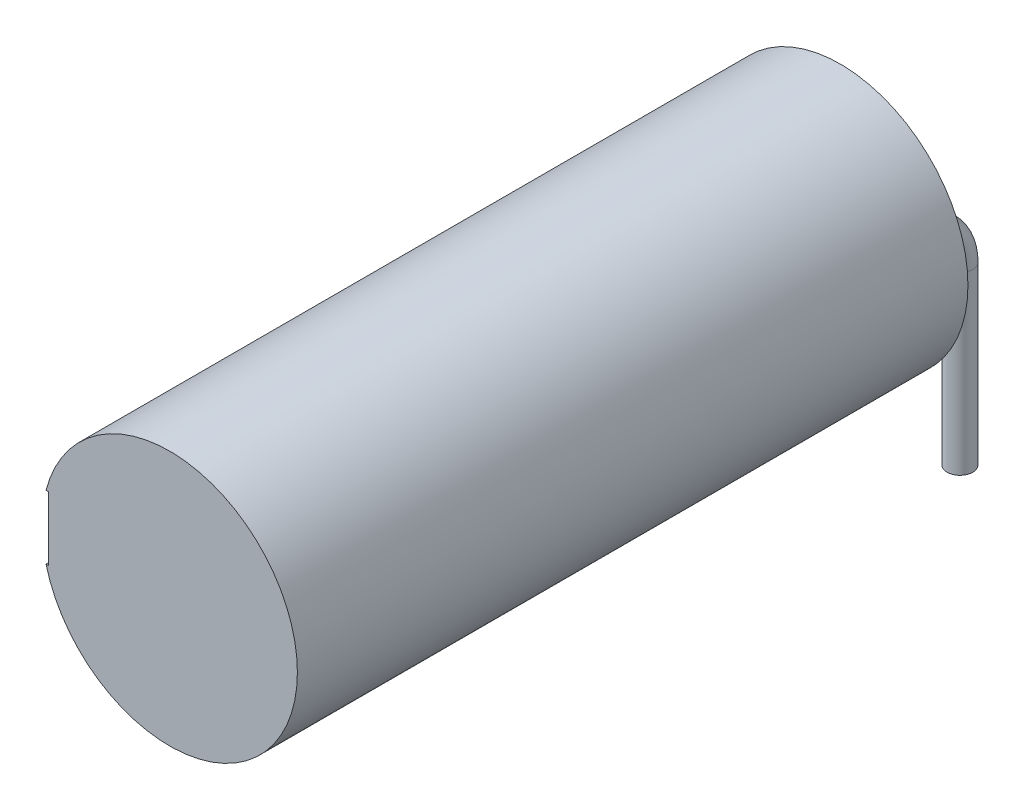
ISO-10303-21;
HEADER;
FILE_DESCRIPTION(('STEP AP214'),'2;1');
FILE_NAME('part.step','',(''),(''),'','','');
FILE_SCHEMA(('AUTOMOTIVE_DESIGN { 1 0 10303 214 1 1 1 1 }'));
ENDSEC;
DATA;
#1=APPLICATION_CONTEXT('core data for automotive mechanical design processes');
#2=APPLICATION_PROTOCOL_DEFINITION('international standard','automotive_design',2000,#1);
#3=PRODUCT_CONTEXT('',#1,'mechanical');
#4=PRODUCT('Part','Part','',(#3));
#5=PRODUCT_RELATED_PRODUCT_CATEGORY('part','',(#4));
#6=PRODUCT_DEFINITION_FORMATION('','',#4);
#7=PRODUCT_DEFINITION_CONTEXT('part definition',#1,'design');
#8=PRODUCT_DEFINITION('design','',#6,#7);
#9=PRODUCT_DEFINITION_SHAPE('','',#8);
#10=(LENGTH_UNIT() NAMED_UNIT(*) SI_UNIT(.MILLI.,.METRE.));
#11=(NAMED_UNIT(*) PLANE_ANGLE_UNIT() SI_UNIT($,.RADIAN.));
#12=(NAMED_UNIT(*) SI_UNIT($,.STERADIAN.) SOLID_ANGLE_UNIT());
#13=UNCERTAINTY_MEASURE_WITH_UNIT(LENGTH_MEASURE(1.E-05),#10,'distance_accuracy_value','');
#14=(GEOMETRIC_REPRESENTATION_CONTEXT(3) GLOBAL_UNCERTAINTY_ASSIGNED_CONTEXT((#13)) GLOBAL_UNIT_ASSIGNED_CONTEXT((#10,
#11,#12)) REPRESENTATION_CONTEXT('',''));
#15=CARTESIAN_POINT('',(0.,0.,0.));
#16=DIRECTION('',(0.,0.,1.));
#17=DIRECTION('',(1.,0.,0.));
#18=AXIS2_PLACEMENT_3D('',#15,#16,#17);
#19=CARTESIAN_POINT('',(-1.75,-7.,-2.));
#20=DIRECTION('',(0.,-1.,0.));
#21=DIRECTION('',(0.,0.,-1.));
#22=AXIS2_PLACEMENT_3D('',#19,#20,#21);
#23=PLANE('',#22);
#24=CARTESIAN_POINT('',(-1.75,-7.,-2.));
#25=DIRECTION('',(0.,-1.,0.));
#26=DIRECTION('',(0.,0.,-1.));
#27=AXIS2_PLACEMENT_3D('',#24,#25,#26);
#28=CIRCLE('',#27,0.4);
#29=CARTESIAN_POINT('',(-1.75,-7.,-2.4));
#30=VERTEX_POINT('',#29);
#31=EDGE_CURVE('E20',#30,#30,#28,.F.);
#32=ORIENTED_EDGE('',*,*,#31,.F.);
#33=EDGE_LOOP('',(#32));
#34=FACE_BOUND('',#33,.T.);
#35=ADVANCED_FACE('F17',(#34),#23,.T.);
#36=CARTESIAN_POINT('',(1.75,-7.,-2.));
#37=DIRECTION('',(0.,-1.,0.));
#38=DIRECTION('',(0.,0.,-1.));
#39=AXIS2_PLACEMENT_3D('',#36,#37,#38);
#40=PLANE('',#39);
#41=CARTESIAN_POINT('',(1.75,-7.,-2.));
#42=DIRECTION('',(0.,-1.,0.));
#43=DIRECTION('',(0.,0.,-1.));
#44=AXIS2_PLACEMENT_3D('',#41,#42,#43);
#45=CIRCLE('',#44,0.4);
#46=CARTESIAN_POINT('',(1.75,-7.,-2.4));
#47=VERTEX_POINT('',#46);
#48=EDGE_CURVE('E169',#47,#47,#45,.F.);
#49=ORIENTED_EDGE('',*,*,#48,.F.);
#50=EDGE_LOOP('',(#49));
#51=FACE_BOUND('',#50,.T.);
#52=ADVANCED_FACE('F192',(#51),#40,.T.);
#53=CARTESIAN_POINT('',(-1.75,-1.5,-2.));
#54=DIRECTION('',(0.,-1.,0.));
#55=DIRECTION('',(0.,0.,-1.));
#56=AXIS2_PLACEMENT_3D('',#53,#54,#55);
#57=CYLINDRICAL_SURFACE('',#56,0.4);
#58=ORIENTED_EDGE('',*,*,#31,.T.);
#59=EDGE_LOOP('',(#58));
#60=FACE_BOUND('',#59,.T.);
#61=CARTESIAN_POINT('',(-1.75,-1.5,-2.));
#62=DIRECTION('',(0.,-1.,0.));
#63=DIRECTION('',(0.,0.,-1.));
#64=AXIS2_PLACEMENT_3D('',#61,#62,#63);
#65=CIRCLE('',#64,0.4);
#66=CARTESIAN_POINT('',(-1.75,-1.5,-2.4));
#67=VERTEX_POINT('',#66);
#68=EDGE_CURVE('E166',#67,#67,#65,.F.);
#69=ORIENTED_EDGE('',*,*,#68,.F.);
#70=EDGE_LOOP('',(#69));
#71=FACE_BOUND('',#70,.T.);
#72=ADVANCED_FACE('F188',(#60,#71),#57,.T.);
#73=CARTESIAN_POINT('',(1.75,-1.5,-2.));
#74=DIRECTION('',(0.,-1.,0.));
#75=DIRECTION('',(0.,0.,-1.));
#76=AXIS2_PLACEMENT_3D('',#73,#74,#75);
#77=CYLINDRICAL_SURFACE('',#76,0.4);
#78=ORIENTED_EDGE('',*,*,#48,.T.);
#79=EDGE_LOOP('',(#78));
#80=FACE_BOUND('',#79,.T.);
#81=CARTESIAN_POINT('',(1.75,-1.5,-2.));
#82=DIRECTION('',(0.,-1.,0.));
#83=DIRECTION('',(0.,0.,-1.));
#84=AXIS2_PLACEMENT_3D('',#81,#82,#83);
#85=CIRCLE('',#84,0.4);
#86=CARTESIAN_POINT('',(1.75,-1.5,-2.4));
#87=VERTEX_POINT('',#86);
#88=EDGE_CURVE('E163',#87,#87,#85,.F.);
#89=ORIENTED_EDGE('',*,*,#88,.F.);
#90=EDGE_LOOP('',(#89));
#91=FACE_BOUND('',#90,.T.);
#92=ADVANCED_FACE('F305',(#80,#91),#77,.T.);
#93=CARTESIAN_POINT('',(-3.7,0.,0.));
#94=DIRECTION('',(1.,0.,0.));
#95=DIRECTION('',(0.,0.,-1.));
#96=AXIS2_PLACEMENT_3D('',#93,#94,#95);
#97=PLANE('',#96);
#98=DIRECTION('',(0.,0.,1.));
#99=VECTOR('',#98,1.);
#100=CARTESIAN_POINT('',(-3.7,-0.169446970487,11.176745696361));
#101=LINE('',#100,#99);
#102=CARTESIAN_POINT('',(-3.7,-0.169446970487,11.176745696361));
#103=VERTEX_POINT('',#102);
#104=CARTESIAN_POINT('',(-3.7,-0.169446970487,9.253668773284));
#105=VERTEX_POINT('',#104);
#106=EDGE_CURVE('E106',#103,#105,#101,.F.);
#107=ORIENTED_EDGE('',*,*,#106,.F.);
#108=DIRECTION('',(0.,1.,0.));
#109=VECTOR('',#108,1.);
#110=CARTESIAN_POINT('',(-3.7,0.343373542333,11.176745696361));
#111=LINE('',#110,#109);
#112=CARTESIAN_POINT('',(-3.7,0.343373542333,11.176745696361));
#113=VERTEX_POINT('',#112);
#114=EDGE_CURVE('E111',#113,#103,#111,.F.);
#115=ORIENTED_EDGE('',*,*,#114,.F.);
#116=DIRECTION('',(0.,0.,-1.));
#117=VECTOR('',#116,1.);
#118=CARTESIAN_POINT('',(-3.7,0.343373542333,9.253668773284));
#119=LINE('',#118,#117);
#120=CARTESIAN_POINT('',(-3.7,0.343373542333,9.253668773284));
#121=VERTEX_POINT('',#120);
#122=EDGE_CURVE('E128',#121,#113,#119,.F.);
#123=ORIENTED_EDGE('',*,*,#122,.F.);
#124=DIRECTION('',(0.,1.,0.));
#125=VECTOR('',#124,1.);
#126=CARTESIAN_POINT('',(-3.7,0.,9.253668773284));
#127=LINE('',#126,#125);
#128=EDGE_CURVE('E113',#105,#121,#127,.T.);
#129=ORIENTED_EDGE('',*,*,#128,.F.);
#130=EDGE_LOOP('',(#107,#115,#123,#129));
#131=FACE_BOUND('',#130,.T.);
#132=ADVANCED_FACE('F108',(#131),#97,.F.);
#133=CARTESIAN_POINT('',(-3.7,0.,0.));
#134=DIRECTION('',(1.,0.,0.));
#135=DIRECTION('',(0.,0.,-1.));
#136=AXIS2_PLACEMENT_3D('',#133,#134,#135);
#137=PLANE('',#136);
#138=DIRECTION('',(0.,0.,1.));
#139=VECTOR('',#138,1.);
#140=CARTESIAN_POINT('',(-3.7,-0.169446970487,19.253668773284));
#141=LINE('',#140,#139);
#142=CARTESIAN_POINT('',(-3.7,-0.169446970487,19.253668773284));
#143=VERTEX_POINT('',#142);
#144=CARTESIAN_POINT('',(-3.7,-0.169446970487,17.330591850207));
#145=VERTEX_POINT('',#144);
#146=EDGE_CURVE('E472',#143,#145,#141,.F.);
#147=ORIENTED_EDGE('',*,*,#146,.F.);
#148=DIRECTION('',(0.,1.,0.));
#149=VECTOR('',#148,1.);
#150=CARTESIAN_POINT('',(-3.7,0.343373542333,19.253668773284));
#151=LINE('',#150,#149);
#152=CARTESIAN_POINT('',(-3.7,0.343373542333,19.253668773284));
#153=VERTEX_POINT('',#152);
#154=EDGE_CURVE('E476',#153,#143,#151,.F.);
#155=ORIENTED_EDGE('',*,*,#154,.F.);
#156=DIRECTION('',(0.,0.,-1.));
#157=VECTOR('',#156,1.);
#158=CARTESIAN_POINT('',(-3.7,0.343373542333,17.330591850207));
#159=LINE('',#158,#157);
#160=CARTESIAN_POINT('',(-3.7,0.343373542333,17.330591850207));
#161=VERTEX_POINT('',#160);
#162=EDGE_CURVE('E490',#161,#153,#159,.F.);
#163=ORIENTED_EDGE('',*,*,#162,.F.);
#164=DIRECTION('',(0.,1.,0.));
#165=VECTOR('',#164,1.);
#166=CARTESIAN_POINT('',(-3.7,0.,17.330591850207));
#167=LINE('',#166,#165);
#168=EDGE_CURVE('E160',#145,#161,#167,.T.);
#169=ORIENTED_EDGE('',*,*,#168,.F.);
#170=EDGE_LOOP('',(#147,#155,#163,#169));
#171=FACE_BOUND('',#170,.T.);
#172=ADVANCED_FACE('F292',(#171),#137,.F.);
#173=CARTESIAN_POINT('',(-3.7,0.,0.));
#174=DIRECTION('',(1.,0.,0.));
#175=DIRECTION('',(0.,0.,-1.));
#176=AXIS2_PLACEMENT_3D('',#173,#174,#175);
#177=PLANE('',#176);
#178=DIRECTION('',(0.,0.,1.));
#179=VECTOR('',#178,1.);
#180=CARTESIAN_POINT('',(-3.7,-0.169446970487,3.099822619438));
#181=LINE('',#180,#179);
#182=CARTESIAN_POINT('',(-3.7,-0.169446970487,3.099822619438));
#183=VERTEX_POINT('',#182);
#184=CARTESIAN_POINT('',(-3.7,-0.169446970487,1.176745696361));
#185=VERTEX_POINT('',#184);
#186=EDGE_CURVE('E546',#183,#185,#181,.F.);
#187=ORIENTED_EDGE('',*,*,#186,.F.);
#188=DIRECTION('',(0.,1.,0.));
#189=VECTOR('',#188,1.);
#190=CARTESIAN_POINT('',(-3.7,0.343373542333,3.099822619438));
#191=LINE('',#190,#189);
#192=CARTESIAN_POINT('',(-3.7,0.343373542333,3.099822619438));
#193=VERTEX_POINT('',#192);
#194=EDGE_CURVE('E543',#193,#183,#191,.F.);
#195=ORIENTED_EDGE('',*,*,#194,.F.);
#196=DIRECTION('',(0.,0.,-1.));
#197=VECTOR('',#196,1.);
#198=CARTESIAN_POINT('',(-3.7,0.343373542333,1.176745696361));
#199=LINE('',#198,#197);
#200=CARTESIAN_POINT('',(-3.7,0.343373542333,1.176745696361));
#201=VERTEX_POINT('',#200);
#202=EDGE_CURVE('E537',#201,#193,#199,.F.);
#203=ORIENTED_EDGE('',*,*,#202,.F.);
#204=DIRECTION('',(0.,1.,0.));
#205=VECTOR('',#204,1.);
#206=CARTESIAN_POINT('',(-3.7,0.,1.176745696361));
#207=LINE('',#206,#205);
#208=EDGE_CURVE('E117',#185,#201,#207,.T.);
#209=ORIENTED_EDGE('',*,*,#208,.F.);
#210=EDGE_LOOP('',(#187,#195,#203,#209));
#211=FACE_BOUND('',#210,.T.);
#212=ADVANCED_FACE('F154',(#211),#177,.F.);
#213=CARTESIAN_POINT('',(-1.75,-1.5,-0.5));
#214=DIRECTION('',(-1.,0.,0.));
#215=DIRECTION('',(0.,0.,1.));
#216=AXIS2_PLACEMENT_3D('',#213,#214,#215);
#217=TOROIDAL_SURFACE('',#216,1.5,0.4);
#218=ORIENTED_EDGE('',*,*,#68,.T.);
#219=EDGE_LOOP('',(#218));
#220=FACE_BOUND('',#219,.T.);
#221=CARTESIAN_POINT('',(-1.75,0.,-0.5));
#222=DIRECTION('',(0.,0.,-1.));
#223=DIRECTION('',(-1.,0.,0.));
#224=AXIS2_PLACEMENT_3D('',#221,#222,#223);
#225=CIRCLE('',#224,0.4);
#226=CARTESIAN_POINT('',(-2.15,0.,-0.5));
#227=VERTEX_POINT('',#226);
#228=EDGE_CURVE('E140',#227,#227,#225,.F.);
#229=ORIENTED_EDGE('',*,*,#228,.F.);
#230=EDGE_LOOP('',(#229));
#231=FACE_BOUND('',#230,.T.);
#232=ADVANCED_FACE('F149',(#220,#231),#217,.T.);
#233=CARTESIAN_POINT('',(1.75,-1.5,-0.5));
#234=DIRECTION('',(-1.,0.,0.));
#235=DIRECTION('',(0.,0.,1.));
#236=AXIS2_PLACEMENT_3D('',#233,#234,#235);
#237=TOROIDAL_SURFACE('',#236,1.5,0.4);
#238=ORIENTED_EDGE('',*,*,#88,.T.);
#239=EDGE_LOOP('',(#238));
#240=FACE_BOUND('',#239,.T.);
#241=CARTESIAN_POINT('',(1.75,0.,-0.5));
#242=DIRECTION('',(0.,0.,-1.));
#243=DIRECTION('',(-1.,0.,0.));
#244=AXIS2_PLACEMENT_3D('',#241,#242,#243);
#245=CIRCLE('',#244,0.4);
#246=CARTESIAN_POINT('',(1.35,0.,-0.5));
#247=VERTEX_POINT('',#246);
#248=EDGE_CURVE('E137',#247,#247,#245,.F.);
#249=ORIENTED_EDGE('',*,*,#248,.F.);
#250=EDGE_LOOP('',(#249));
#251=FACE_BOUND('',#250,.T.);
#252=ADVANCED_FACE('F145',(#240,#251),#237,.T.);
#253=CARTESIAN_POINT('',(-3.7,-0.169446970487,11.176745696361));
#254=DIRECTION('',(0.,1.,0.));
#255=DIRECTION('',(0.,0.,1.));
#256=AXIS2_PLACEMENT_3D('',#253,#254,#255);
#257=PLANE('',#256);
#258=ORIENTED_EDGE('',*,*,#106,.T.);
#259=DIRECTION('',(1.,0.,0.));
#260=VECTOR('',#259,1.);
#261=CARTESIAN_POINT('',(-3.7,-0.169446970487,9.253668773284));
#262=LINE('',#261,#260);
#263=CARTESIAN_POINT('',(-3.8,-0.169446970487,9.253668773284));
#264=VERTEX_POINT('',#263);
#265=EDGE_CURVE('E500',#264,#105,#262,.T.);
#266=ORIENTED_EDGE('',*,*,#265,.F.);
#267=DIRECTION('',(0.,0.,-1.));
#268=VECTOR('',#267,1.);
#269=CARTESIAN_POINT('',(-3.8,-0.169446970487,21.));
#270=LINE('',#269,#268);
#271=CARTESIAN_POINT('',(-3.8,-0.169446970487,11.176745696361));
#272=VERTEX_POINT('',#271);
#273=EDGE_CURVE('E124',#264,#272,#270,.F.);
#274=ORIENTED_EDGE('',*,*,#273,.T.);
#275=DIRECTION('',(-1.,0.,0.));
#276=VECTOR('',#275,1.);
#277=CARTESIAN_POINT('',(-3.7,-0.169446970487,11.176745696361));
#278=LINE('',#277,#276);
#279=EDGE_CURVE('E121',#103,#272,#278,.T.);
#280=ORIENTED_EDGE('',*,*,#279,.F.);
#281=EDGE_LOOP('',(#258,#266,#274,#280));
#282=FACE_BOUND('',#281,.T.);
#283=ADVANCED_FACE('F122',(#282),#257,.T.);
#284=CARTESIAN_POINT('',(-3.7,0.343373542333,11.176745696361));
#285=DIRECTION('',(0.,0.,-1.));
#286=DIRECTION('',(-1.,0.,0.));
#287=AXIS2_PLACEMENT_3D('',#284,#285,#286);
#288=PLANE('',#287);
#289=ORIENTED_EDGE('',*,*,#114,.T.);
#290=ORIENTED_EDGE('',*,*,#279,.T.);
#291=DIRECTION('',(0.,1.,0.));
#292=VECTOR('',#291,1.);
#293=CARTESIAN_POINT('',(-3.8,1.,11.176745696361));
#294=LINE('',#293,#292);
#295=CARTESIAN_POINT('',(-3.8,0.343373542333,11.176745696361));
#296=VERTEX_POINT('',#295);
#297=EDGE_CURVE('E517',#272,#296,#294,.T.);
#298=ORIENTED_EDGE('',*,*,#297,.T.);
#299=DIRECTION('',(1.,0.,0.));
#300=VECTOR('',#299,1.);
#301=CARTESIAN_POINT('',(-3.7,0.343373542333,11.176745696361));
#302=LINE('',#301,#300);
#303=EDGE_CURVE('E132',#113,#296,#302,.F.);
#304=ORIENTED_EDGE('',*,*,#303,.F.);
#305=EDGE_LOOP('',(#289,#290,#298,#304));
#306=FACE_BOUND('',#305,.T.);
#307=ADVANCED_FACE('F130',(#306),#288,.T.);
#308=CARTESIAN_POINT('',(-3.7,0.343373542333,9.253668773284));
#309=DIRECTION('',(0.,-1.,0.));
#310=DIRECTION('',(0.,0.,-1.));
#311=AXIS2_PLACEMENT_3D('',#308,#309,#310);
#312=PLANE('',#311);
#313=ORIENTED_EDGE('',*,*,#122,.T.);
#314=ORIENTED_EDGE('',*,*,#303,.T.);
#315=DIRECTION('',(0.,0.,-1.));
#316=VECTOR('',#315,1.);
#317=CARTESIAN_POINT('',(-3.8,0.343373542333,21.));
#318=LINE('',#317,#316);
#319=CARTESIAN_POINT('',(-3.8,0.343373542333,9.253668773284));
#320=VERTEX_POINT('',#319);
#321=EDGE_CURVE('E507',#296,#320,#318,.T.);
#322=ORIENTED_EDGE('',*,*,#321,.T.);
#323=DIRECTION('',(1.,0.,0.));
#324=VECTOR('',#323,1.);
#325=CARTESIAN_POINT('',(-3.7,0.343373542333,9.253668773284));
#326=LINE('',#325,#324);
#327=EDGE_CURVE('E480',#121,#320,#326,.F.);
#328=ORIENTED_EDGE('',*,*,#327,.F.);
#329=EDGE_LOOP('',(#313,#314,#322,#328));
#330=FACE_BOUND('',#329,.T.);
#331=ADVANCED_FACE('F266',(#330),#312,.T.);
#332=CARTESIAN_POINT('',(-3.7,-0.169446970487,9.253668773284));
#333=DIRECTION('',(0.,0.,1.));
#334=DIRECTION('',(1.,0.,0.));
#335=AXIS2_PLACEMENT_3D('',#332,#333,#334);
#336=PLANE('',#335);
#337=ORIENTED_EDGE('',*,*,#128,.T.);
#338=ORIENTED_EDGE('',*,*,#327,.T.);
#339=DIRECTION('',(0.,1.,0.));
#340=VECTOR('',#339,1.);
#341=CARTESIAN_POINT('',(-3.8,1.,9.253668773284));
#342=LINE('',#341,#340);
#343=EDGE_CURVE('E510',#320,#264,#342,.F.);
#344=ORIENTED_EDGE('',*,*,#343,.T.);
#345=ORIENTED_EDGE('',*,*,#265,.T.);
#346=EDGE_LOOP('',(#337,#338,#344,#345));
#347=FACE_BOUND('',#346,.T.);
#348=ADVANCED_FACE('F262',(#347),#336,.T.);
#349=CARTESIAN_POINT('',(-3.7,-0.169446970487,19.253668773284));
#350=DIRECTION('',(0.,1.,0.));
#351=DIRECTION('',(0.,0.,1.));
#352=AXIS2_PLACEMENT_3D('',#349,#350,#351);
#353=PLANE('',#352);
#354=ORIENTED_EDGE('',*,*,#146,.T.);
#355=DIRECTION('',(1.,0.,0.));
#356=VECTOR('',#355,1.);
#357=CARTESIAN_POINT('',(-3.7,-0.169446970487,17.330591850207));
#358=LINE('',#357,#356);
#359=CARTESIAN_POINT('',(-3.8,-0.169446970487,17.330591850207));
#360=VERTEX_POINT('',#359);
#361=EDGE_CURVE('E552',#360,#145,#358,.T.);
#362=ORIENTED_EDGE('',*,*,#361,.F.);
#363=DIRECTION('',(0.,0.,-1.));
#364=VECTOR('',#363,1.);
#365=CARTESIAN_POINT('',(-3.8,-0.169446970487,21.));
#366=LINE('',#365,#364);
#367=CARTESIAN_POINT('',(-3.8,-0.169446970487,19.253668773284));
#368=VERTEX_POINT('',#367);
#369=EDGE_CURVE('E487',#360,#368,#366,.F.);
#370=ORIENTED_EDGE('',*,*,#369,.T.);
#371=DIRECTION('',(-1.,0.,0.));
#372=VECTOR('',#371,1.);
#373=CARTESIAN_POINT('',(-3.7,-0.169446970487,19.253668773284));
#374=LINE('',#373,#372);
#375=EDGE_CURVE('E484',#143,#368,#374,.T.);
#376=ORIENTED_EDGE('',*,*,#375,.F.);
#377=EDGE_LOOP('',(#354,#362,#370,#376));
#378=FACE_BOUND('',#377,.T.);
#379=ADVANCED_FACE('F258',(#378),#353,.T.);
#380=CARTESIAN_POINT('',(-3.7,0.343373542333,19.253668773284));
#381=DIRECTION('',(0.,0.,-1.));
#382=DIRECTION('',(-1.,0.,0.));
#383=AXIS2_PLACEMENT_3D('',#380,#381,#382);
#384=PLANE('',#383);
#385=ORIENTED_EDGE('',*,*,#154,.T.);
#386=ORIENTED_EDGE('',*,*,#375,.T.);
#387=DIRECTION('',(0.,1.,0.));
#388=VECTOR('',#387,1.);
#389=CARTESIAN_POINT('',(-3.8,1.,19.253668773284));
#390=LINE('',#389,#388);
#391=CARTESIAN_POINT('',(-3.8,0.343373542333,19.253668773284));
#392=VERTEX_POINT('',#391);
#393=EDGE_CURVE('E515',#368,#392,#390,.T.);
#394=ORIENTED_EDGE('',*,*,#393,.T.);
#395=DIRECTION('',(1.,0.,0.));
#396=VECTOR('',#395,1.);
#397=CARTESIAN_POINT('',(-3.7,0.343373542333,19.253668773284));
#398=LINE('',#397,#396);
#399=EDGE_CURVE('E493',#153,#392,#398,.F.);
#400=ORIENTED_EDGE('',*,*,#399,.F.);
#401=EDGE_LOOP('',(#385,#386,#394,#400));
#402=FACE_BOUND('',#401,.T.);
#403=ADVANCED_FACE('F254',(#402),#384,.T.);
#404=CARTESIAN_POINT('',(-3.7,0.343373542333,17.330591850207));
#405=DIRECTION('',(0.,-1.,0.));
#406=DIRECTION('',(0.,0.,-1.));
#407=AXIS2_PLACEMENT_3D('',#404,#405,#406);
#408=PLANE('',#407);
#409=ORIENTED_EDGE('',*,*,#162,.T.);
#410=ORIENTED_EDGE('',*,*,#399,.T.);
#411=DIRECTION('',(0.,0.,-1.));
#412=VECTOR('',#411,1.);
#413=CARTESIAN_POINT('',(-3.8,0.343373542333,21.));
#414=LINE('',#413,#412);
#415=CARTESIAN_POINT('',(-3.8,0.343373542333,17.330591850207));
#416=VERTEX_POINT('',#415);
#417=EDGE_CURVE('E559',#392,#416,#414,.T.);
#418=ORIENTED_EDGE('',*,*,#417,.T.);
#419=DIRECTION('',(1.,0.,0.));
#420=VECTOR('',#419,1.);
#421=CARTESIAN_POINT('',(-3.7,0.343373542333,17.330591850207));
#422=LINE('',#421,#420);
#423=EDGE_CURVE('E549',#161,#416,#422,.F.);
#424=ORIENTED_EDGE('',*,*,#423,.F.);
#425=EDGE_LOOP('',(#409,#410,#418,#424));
#426=FACE_BOUND('',#425,.T.);
#427=ADVANCED_FACE('F250',(#426),#408,.T.);
#428=CARTESIAN_POINT('',(-3.7,-0.169446970487,17.330591850207));
#429=DIRECTION('',(0.,0.,1.));
#430=DIRECTION('',(1.,0.,0.));
#431=AXIS2_PLACEMENT_3D('',#428,#429,#430);
#432=PLANE('',#431);
#433=ORIENTED_EDGE('',*,*,#168,.T.);
#434=ORIENTED_EDGE('',*,*,#423,.T.);
#435=DIRECTION('',(0.,1.,0.));
#436=VECTOR('',#435,1.);
#437=CARTESIAN_POINT('',(-3.8,1.,17.330591850207));
#438=LINE('',#437,#436);
#439=EDGE_CURVE('E562',#416,#360,#438,.F.);
#440=ORIENTED_EDGE('',*,*,#439,.T.);
#441=ORIENTED_EDGE('',*,*,#361,.T.);
#442=EDGE_LOOP('',(#433,#434,#440,#441));
#443=FACE_BOUND('',#442,.T.);
#444=ADVANCED_FACE('F246',(#443),#432,.T.);
#445=CARTESIAN_POINT('',(-3.7,-0.169446970487,3.099822619438));
#446=DIRECTION('',(0.,1.,0.));
#447=DIRECTION('',(0.,0.,1.));
#448=AXIS2_PLACEMENT_3D('',#445,#446,#447);
#449=PLANE('',#448);
#450=ORIENTED_EDGE('',*,*,#186,.T.);
#451=DIRECTION('',(1.,0.,0.));
#452=VECTOR('',#451,1.);
#453=CARTESIAN_POINT('',(-3.7,-0.169446970487,1.176745696361));
#454=LINE('',#453,#452);
#455=CARTESIAN_POINT('',(-3.8,-0.169446970487,1.176745696361));
#456=VERTEX_POINT('',#455);
#457=EDGE_CURVE('E531',#456,#185,#454,.T.);
#458=ORIENTED_EDGE('',*,*,#457,.F.);
#459=DIRECTION('',(0.,0.,-1.));
#460=VECTOR('',#459,1.);
#461=CARTESIAN_POINT('',(-3.8,-0.169446970487,21.));
#462=LINE('',#461,#460);
#463=CARTESIAN_POINT('',(-3.8,-0.169446970487,3.099822619438));
#464=VERTEX_POINT('',#463);
#465=EDGE_CURVE('E566',#456,#464,#462,.F.);
#466=ORIENTED_EDGE('',*,*,#465,.T.);
#467=DIRECTION('',(-1.,0.,0.));
#468=VECTOR('',#467,1.);
#469=CARTESIAN_POINT('',(-3.7,-0.169446970487,3.099822619438));
#470=LINE('',#469,#468);
#471=EDGE_CURVE('E540',#183,#464,#470,.T.);
#472=ORIENTED_EDGE('',*,*,#471,.F.);
#473=EDGE_LOOP('',(#450,#458,#466,#472));
#474=FACE_BOUND('',#473,.T.);
#475=ADVANCED_FACE('F242',(#474),#449,.T.);
#476=CARTESIAN_POINT('',(-3.7,0.343373542333,3.099822619438));
#477=DIRECTION('',(0.,0.,-1.));
#478=DIRECTION('',(-1.,0.,0.));
#479=AXIS2_PLACEMENT_3D('',#476,#477,#478);
#480=PLANE('',#479);
#481=ORIENTED_EDGE('',*,*,#194,.T.);
#482=ORIENTED_EDGE('',*,*,#471,.T.);
#483=DIRECTION('',(0.,1.,0.));
#484=VECTOR('',#483,1.);
#485=CARTESIAN_POINT('',(-3.8,1.,3.099822619438));
#486=LINE('',#485,#484);
#487=CARTESIAN_POINT('',(-3.8,0.343373542333,3.099822619438));
#488=VERTEX_POINT('',#487);
#489=EDGE_CURVE('E569',#464,#488,#486,.T.);
#490=ORIENTED_EDGE('',*,*,#489,.T.);
#491=DIRECTION('',(1.,0.,0.));
#492=VECTOR('',#491,1.);
#493=CARTESIAN_POINT('',(-3.7,0.343373542333,3.099822619438));
#494=LINE('',#493,#492);
#495=EDGE_CURVE('E534',#193,#488,#494,.F.);
#496=ORIENTED_EDGE('',*,*,#495,.F.);
#497=EDGE_LOOP('',(#481,#482,#490,#496));
#498=FACE_BOUND('',#497,.T.);
#499=ADVANCED_FACE('F238',(#498),#480,.T.);
#500=CARTESIAN_POINT('',(-3.7,0.343373542333,1.176745696361));
#501=DIRECTION('',(0.,-1.,0.));
#502=DIRECTION('',(0.,0.,-1.));
#503=AXIS2_PLACEMENT_3D('',#500,#501,#502);
#504=PLANE('',#503);
#505=ORIENTED_EDGE('',*,*,#202,.T.);
#506=ORIENTED_EDGE('',*,*,#495,.T.);
#507=DIRECTION('',(0.,0.,-1.));
#508=VECTOR('',#507,1.);
#509=CARTESIAN_POINT('',(-3.8,0.343373542333,21.));
#510=LINE('',#509,#508);
#511=CARTESIAN_POINT('',(-3.8,0.343373542333,1.176745696361));
#512=VERTEX_POINT('',#511);
#513=EDGE_CURVE('E588',#488,#512,#510,.T.);
#514=ORIENTED_EDGE('',*,*,#513,.T.);
#515=DIRECTION('',(1.,0.,0.));
#516=VECTOR('',#515,1.);
#517=CARTESIAN_POINT('',(-3.7,0.343373542333,1.176745696361));
#518=LINE('',#517,#516);
#519=EDGE_CURVE('E528',#201,#512,#518,.F.);
#520=ORIENTED_EDGE('',*,*,#519,.F.);
#521=EDGE_LOOP('',(#505,#506,#514,#520));
#522=FACE_BOUND('',#521,.T.);
#523=ADVANCED_FACE('F234',(#522),#504,.T.);
#524=CARTESIAN_POINT('',(-3.7,-0.169446970487,1.176745696361));
#525=DIRECTION('',(0.,0.,1.));
#526=DIRECTION('',(1.,0.,0.));
#527=AXIS2_PLACEMENT_3D('',#524,#525,#526);
#528=PLANE('',#527);
#529=ORIENTED_EDGE('',*,*,#208,.T.);
#530=ORIENTED_EDGE('',*,*,#519,.T.);
#531=DIRECTION('',(0.,1.,0.));
#532=VECTOR('',#531,1.);
#533=CARTESIAN_POINT('',(-3.8,1.,1.176745696361));
#534=LINE('',#533,#532);
#535=EDGE_CURVE('E181',#512,#456,#534,.F.);
#536=ORIENTED_EDGE('',*,*,#535,.T.);
#537=ORIENTED_EDGE('',*,*,#457,.T.);
#538=EDGE_LOOP('',(#529,#530,#536,#537));
#539=FACE_BOUND('',#538,.T.);
#540=ADVANCED_FACE('F230',(#539),#528,.T.);
#541=CARTESIAN_POINT('',(-1.75,0.,0.));
#542=DIRECTION('',(0.,0.,-1.));
#543=DIRECTION('',(-1.,0.,0.));
#544=AXIS2_PLACEMENT_3D('',#541,#542,#543);
#545=CYLINDRICAL_SURFACE('',#544,0.4);
#546=ORIENTED_EDGE('',*,*,#228,.T.);
#547=EDGE_LOOP('',(#546));
#548=FACE_BOUND('',#547,.T.);
#549=CARTESIAN_POINT('',(-1.75,0.,0.));
#550=DIRECTION('',(0.,0.,-1.));
#551=DIRECTION('',(-1.,0.,0.));
#552=AXIS2_PLACEMENT_3D('',#549,#550,#551);
#553=CIRCLE('',#552,0.4);
#554=CARTESIAN_POINT('',(-2.15,0.,0.));
#555=VERTEX_POINT('',#554);
#556=EDGE_CURVE('E179',#555,#555,#553,.T.);
#557=ORIENTED_EDGE('',*,*,#556,.T.);
#558=EDGE_LOOP('',(#557));
#559=FACE_BOUND('',#558,.T.);
#560=ADVANCED_FACE('F226',(#548,#559),#545,.T.);
#561=CARTESIAN_POINT('',(1.75,0.,0.));
#562=DIRECTION('',(0.,0.,-1.));
#563=DIRECTION('',(-1.,0.,0.));
#564=AXIS2_PLACEMENT_3D('',#561,#562,#563);
#565=CYLINDRICAL_SURFACE('',#564,0.4);
#566=ORIENTED_EDGE('',*,*,#248,.T.);
#567=EDGE_LOOP('',(#566));
#568=FACE_BOUND('',#567,.T.);
#569=CARTESIAN_POINT('',(1.75,0.,0.));
#570=DIRECTION('',(0.,0.,-1.));
#571=DIRECTION('',(-1.,0.,0.));
#572=AXIS2_PLACEMENT_3D('',#569,#570,#571);
#573=CIRCLE('',#572,0.4);
#574=CARTESIAN_POINT('',(1.35,0.,0.));
#575=VERTEX_POINT('',#574);
#576=EDGE_CURVE('E175',#575,#575,#573,.T.);
#577=ORIENTED_EDGE('',*,*,#576,.T.);
#578=EDGE_LOOP('',(#577));
#579=FACE_BOUND('',#578,.T.);
#580=ADVANCED_FACE('F222',(#568,#579),#565,.T.);
#581=CARTESIAN_POINT('',(-3.8,1.,21.));
#582=DIRECTION('',(1.,0.,0.));
#583=DIRECTION('',(0.,0.,-1.));
#584=AXIS2_PLACEMENT_3D('',#581,#582,#583);
#585=PLANE('',#584);
#586=ORIENTED_EDGE('',*,*,#513,.F.);
#587=ORIENTED_EDGE('',*,*,#489,.F.);
#588=ORIENTED_EDGE('',*,*,#465,.F.);
#589=ORIENTED_EDGE('',*,*,#535,.F.);
#590=EDGE_LOOP('',(#586,#587,#588,#589));
#591=FACE_BOUND('',#590,.T.);
#592=ORIENTED_EDGE('',*,*,#417,.F.);
#593=ORIENTED_EDGE('',*,*,#393,.F.);
#594=ORIENTED_EDGE('',*,*,#369,.F.);
#595=ORIENTED_EDGE('',*,*,#439,.F.);
#596=EDGE_LOOP('',(#592,#593,#594,#595));
#597=FACE_BOUND('',#596,.T.);
#598=DIRECTION('',(0.,0.,1.));
#599=VECTOR('',#598,1.);
#600=CARTESIAN_POINT('',(-3.8,-1.,21.));
#601=LINE('',#600,#599);
#602=CARTESIAN_POINT('',(-3.8,-1.,0.));
#603=VERTEX_POINT('',#602);
#604=CARTESIAN_POINT('',(-3.8,-1.,21.));
#605=VERTEX_POINT('',#604);
#606=EDGE_CURVE('E56',#603,#605,#601,.T.);
#607=ORIENTED_EDGE('',*,*,#606,.T.);
#608=DIRECTION('',(0.,1.,0.));
#609=VECTOR('',#608,1.);
#610=CARTESIAN_POINT('',(-3.8,0.,21.));
#611=LINE('',#610,#609);
#612=CARTESIAN_POINT('',(-3.8,1.,21.));
#613=VERTEX_POINT('',#612);
#614=EDGE_CURVE('E601',#613,#605,#611,.F.);
#615=ORIENTED_EDGE('',*,*,#614,.F.);
#616=DIRECTION('',(0.,0.,1.));
#617=VECTOR('',#616,1.);
#618=CARTESIAN_POINT('',(-3.8,0.999999999999999,21.));
#619=LINE('',#618,#617);
#620=CARTESIAN_POINT('',(-3.8,0.999999999999999,0.));
#621=VERTEX_POINT('',#620);
#622=EDGE_CURVE('E523',#613,#621,#619,.F.);
#623=ORIENTED_EDGE('',*,*,#622,.T.);
#624=DIRECTION('',(0.,1.,0.));
#625=VECTOR('',#624,1.);
#626=CARTESIAN_POINT('',(-3.8,0.,0.));
#627=LINE('',#626,#625);
#628=EDGE_CURVE('E178',#621,#603,#627,.F.);
#629=ORIENTED_EDGE('',*,*,#628,.T.);
#630=EDGE_LOOP('',(#607,#615,#623,#629));
#631=FACE_BOUND('',#630,.T.);
#632=ORIENTED_EDGE('',*,*,#321,.F.);
#633=ORIENTED_EDGE('',*,*,#297,.F.);
#634=ORIENTED_EDGE('',*,*,#273,.F.);
#635=ORIENTED_EDGE('',*,*,#343,.F.);
#636=EDGE_LOOP('',(#632,#633,#634,#635));
#637=FACE_BOUND('',#636,.T.);
#638=ADVANCED_FACE('F219',(#591,#597,#631,#637),#585,.F.);
#639=CARTESIAN_POINT('',(0.,0.,0.));
#640=DIRECTION('',(0.,0.,1.));
#641=DIRECTION('',(1.,0.,0.));
#642=AXIS2_PLACEMENT_3D('',#639,#640,#641);
#643=PLANE('',#642);
#644=DIRECTION('',(1.,0.,0.));
#645=VECTOR('',#644,1.);
#646=CARTESIAN_POINT('',(-3.8,-1.,0.));
#647=LINE('',#646,#645);
#648=CARTESIAN_POINT('',(-3.8729833462074,-1.00000000000005,0.));
#649=VERTEX_POINT('',#648);
#650=EDGE_CURVE('E174',#649,#603,#647,.T.);
#651=ORIENTED_EDGE('',*,*,#650,.T.);
#652=ORIENTED_EDGE('',*,*,#628,.F.);
#653=DIRECTION('',(-1.,0.,0.));
#654=VECTOR('',#653,1.);
#655=CARTESIAN_POINT('',(-3.872983346207,1.,0.));
#656=LINE('',#655,#654);
#657=CARTESIAN_POINT('',(-3.8729833462074,1.00000000000005,0.));
#658=VERTEX_POINT('',#657);
#659=EDGE_CURVE('E525',#621,#658,#656,.T.);
#660=ORIENTED_EDGE('',*,*,#659,.T.);
#661=CARTESIAN_POINT('',(0.,0.,0.));
#662=DIRECTION('',(0.,0.,-1.));
#663=DIRECTION('',(-1.,0.,0.));
#664=AXIS2_PLACEMENT_3D('',#661,#662,#663);
#665=CIRCLE('',#664,4.);
#666=EDGE_CURVE('E47',#649,#658,#665,.F.);
#667=ORIENTED_EDGE('',*,*,#666,.F.);
#668=EDGE_LOOP('',(#651,#652,#660,#667));
#669=FACE_BOUND('',#668,.T.);
#670=ORIENTED_EDGE('',*,*,#576,.F.);
#671=EDGE_LOOP('',(#670));
#672=FACE_BOUND('',#671,.T.);
#673=ORIENTED_EDGE('',*,*,#556,.F.);
#674=EDGE_LOOP('',(#673));
#675=FACE_BOUND('',#674,.T.);
#676=ADVANCED_FACE('F215',(#669,#672,#675),#643,.F.);
#677=CARTESIAN_POINT('',(-3.872983346207,1.,21.));
#678=DIRECTION('',(0.,1.,0.));
#679=DIRECTION('',(-1.,0.,0.));
#680=AXIS2_PLACEMENT_3D('',#677,#678,#679);
#681=PLANE('',#680);
#682=ORIENTED_EDGE('',*,*,#622,.F.);
#683=DIRECTION('',(1.,0.,0.));
#684=VECTOR('',#683,1.);
#685=CARTESIAN_POINT('',(0.,1.,21.));
#686=LINE('',#685,#684);
#687=CARTESIAN_POINT('',(-3.8729833462074,1.00000000000005,21.));
#688=VERTEX_POINT('',#687);
#689=EDGE_CURVE('E603',#688,#613,#686,.T.);
#690=ORIENTED_EDGE('',*,*,#689,.F.);
#691=DIRECTION('',(0.,0.,-1.));
#692=VECTOR('',#691,1.);
#693=CARTESIAN_POINT('',(-3.87298334620739,1.0000000000001,21.));
#694=LINE('',#693,#692);
#695=EDGE_CURVE('E172',#658,#688,#694,.F.);
#696=ORIENTED_EDGE('',*,*,#695,.F.);
#697=ORIENTED_EDGE('',*,*,#659,.F.);
#698=EDGE_LOOP('',(#682,#690,#696,#697));
#699=FACE_BOUND('',#698,.T.);
#700=ADVANCED_FACE('F212',(#699),#681,.F.);
#701=CARTESIAN_POINT('',(0.,0.,21.));
#702=DIRECTION('',(0.,0.,1.));
#703=DIRECTION('',(1.,0.,0.));
#704=AXIS2_PLACEMENT_3D('',#701,#702,#703);
#705=PLANE('',#704);
#706=ORIENTED_EDGE('',*,*,#614,.T.);
#707=DIRECTION('',(1.,0.,0.));
#708=VECTOR('',#707,1.);
#709=CARTESIAN_POINT('',(-3.8,-1.,21.));
#710=LINE('',#709,#708);
#711=CARTESIAN_POINT('',(-3.8729833462074,-1.00000000000005,21.));
#712=VERTEX_POINT('',#711);
#713=EDGE_CURVE('E35',#605,#712,#710,.F.);
#714=ORIENTED_EDGE('',*,*,#713,.T.);
#715=CARTESIAN_POINT('',(0.,0.,21.));
#716=DIRECTION('',(0.,0.,-1.));
#717=DIRECTION('',(-1.,0.,0.));
#718=AXIS2_PLACEMENT_3D('',#715,#716,#717);
#719=CIRCLE('',#718,4.);
#720=EDGE_CURVE('E26',#688,#712,#719,.T.);
#721=ORIENTED_EDGE('',*,*,#720,.F.);
#722=ORIENTED_EDGE('',*,*,#689,.T.);
#723=EDGE_LOOP('',(#706,#714,#721,#722));
#724=FACE_BOUND('',#723,.T.);
#725=ADVANCED_FACE('F206',(#724),#705,.T.);
#726=CARTESIAN_POINT('',(-3.8,-1.,21.));
#727=DIRECTION('',(0.,-1.,0.));
#728=DIRECTION('',(1.,0.,0.));
#729=AXIS2_PLACEMENT_3D('',#726,#727,#728);
#730=PLANE('',#729);
#731=DIRECTION('',(0.,0.,-1.));
#732=VECTOR('',#731,1.);
#733=CARTESIAN_POINT('',(-3.87298334620739,-1.0000000000001,21.));
#734=LINE('',#733,#732);
#735=EDGE_CURVE('E11',#712,#649,#734,.T.);
#736=ORIENTED_EDGE('',*,*,#735,.F.);
#737=ORIENTED_EDGE('',*,*,#713,.F.);
#738=ORIENTED_EDGE('',*,*,#606,.F.);
#739=ORIENTED_EDGE('',*,*,#650,.F.);
#740=EDGE_LOOP('',(#736,#737,#738,#739));
#741=FACE_BOUND('',#740,.T.);
#742=ADVANCED_FACE('F200',(#741),#730,.F.);
#743=CARTESIAN_POINT('',(0.,0.,21.));
#744=DIRECTION('',(0.,0.,-1.));
#745=DIRECTION('',(-1.,0.,0.));
#746=AXIS2_PLACEMENT_3D('',#743,#744,#745);
#747=CYLINDRICAL_SURFACE('',#746,4.);
#748=ORIENTED_EDGE('',*,*,#720,.T.);
#749=ORIENTED_EDGE('',*,*,#735,.T.);
#750=ORIENTED_EDGE('',*,*,#666,.T.);
#751=ORIENTED_EDGE('',*,*,#695,.T.);
#752=EDGE_LOOP('',(#748,#749,#750,#751));
#753=FACE_BOUND('',#752,.T.);
#754=ADVANCED_FACE('F198',(#753),#747,.T.);
#755=CLOSED_SHELL('',(#35,#52,#72,#92,#132,#172,#212,#232,#252,#283,#307,#331,#348,#379,#403,
#427,#444,#475,#499,#523,#540,#560,#580,#638,#676,#700,#725,#742,#754));
#756=MANIFOLD_SOLID_BREP('B1',#755);
#757=ADVANCED_BREP_SHAPE_REPRESENTATION('',(#18,#756),#14);
#758=SHAPE_DEFINITION_REPRESENTATION(#9,#757);
ENDSEC;
END-ISO-10303-21;
